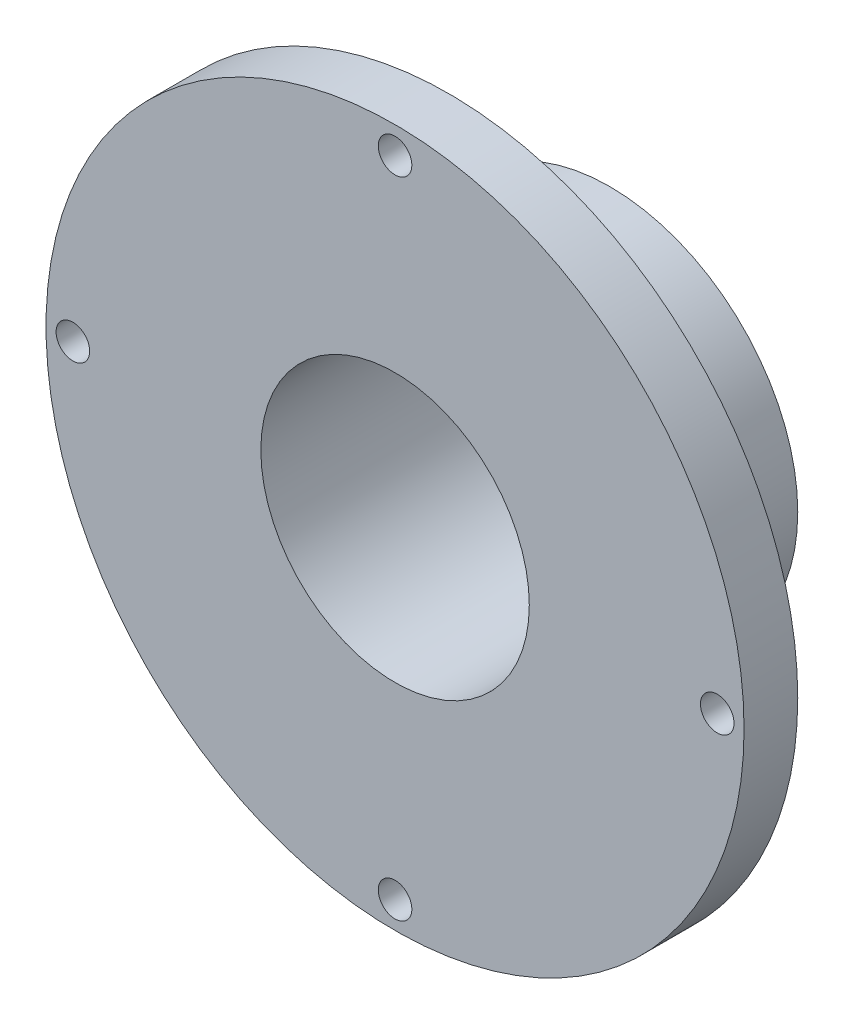
ISO-10303-21;
HEADER;
FILE_DESCRIPTION(('STEP AP214'),'2;1');
FILE_NAME('part.step','',(''),(''),'','','');
FILE_SCHEMA(('AUTOMOTIVE_DESIGN { 1 0 10303 214 1 1 1 1 }'));
ENDSEC;
DATA;
#1=APPLICATION_CONTEXT('core data for automotive mechanical design processes');
#2=APPLICATION_PROTOCOL_DEFINITION('international standard','automotive_design',2000,#1);
#3=PRODUCT_CONTEXT('',#1,'mechanical');
#4=PRODUCT('Part','Part','',(#3));
#5=PRODUCT_RELATED_PRODUCT_CATEGORY('part','',(#4));
#6=PRODUCT_DEFINITION_FORMATION('','',#4);
#7=PRODUCT_DEFINITION_CONTEXT('part definition',#1,'design');
#8=PRODUCT_DEFINITION('design','',#6,#7);
#9=PRODUCT_DEFINITION_SHAPE('','',#8);
#10=(LENGTH_UNIT() NAMED_UNIT(*) SI_UNIT(.MILLI.,.METRE.));
#11=(NAMED_UNIT(*) PLANE_ANGLE_UNIT() SI_UNIT($,.RADIAN.));
#12=(NAMED_UNIT(*) SI_UNIT($,.STERADIAN.) SOLID_ANGLE_UNIT());
#13=UNCERTAINTY_MEASURE_WITH_UNIT(LENGTH_MEASURE(1.E-05),#10,'distance_accuracy_value','');
#14=(GEOMETRIC_REPRESENTATION_CONTEXT(3) GLOBAL_UNCERTAINTY_ASSIGNED_CONTEXT((#13)) GLOBAL_UNIT_ASSIGNED_CONTEXT((#10,
#11,#12)) REPRESENTATION_CONTEXT('',''));
#15=CARTESIAN_POINT('',(0.,0.,0.));
#16=DIRECTION('',(0.,0.,1.));
#17=DIRECTION('',(1.,0.,0.));
#18=AXIS2_PLACEMENT_3D('',#15,#16,#17);
#19=CARTESIAN_POINT('',(0.,0.,25.4));
#20=DIRECTION('',(0.,0.,-1.));
#21=DIRECTION('',(-1.,0.,0.));
#22=AXIS2_PLACEMENT_3D('',#19,#20,#21);
#23=CYLINDRICAL_SURFACE('',#22,41.275);
#24=CARTESIAN_POINT('',(0.,0.,19.05));
#25=DIRECTION('',(0.,0.,1.));
#26=DIRECTION('',(1.,0.,0.));
#27=AXIS2_PLACEMENT_3D('',#24,#25,#26);
#28=CIRCLE('',#27,41.275);
#29=CARTESIAN_POINT('',(41.275,0.,19.05));
#30=VERTEX_POINT('',#29);
#31=EDGE_CURVE('E45',#30,#30,#28,.T.);
#32=ORIENTED_EDGE('',*,*,#31,.T.);
#33=EDGE_LOOP('',(#32));
#34=FACE_BOUND('',#33,.T.);
#35=CARTESIAN_POINT('',(0.,0.,25.4));
#36=DIRECTION('',(0.,0.,1.));
#37=DIRECTION('',(1.,0.,0.));
#38=AXIS2_PLACEMENT_3D('',#35,#36,#37);
#39=CIRCLE('',#38,41.275);
#40=CARTESIAN_POINT('',(41.275,0.,25.4));
#41=VERTEX_POINT('',#40);
#42=EDGE_CURVE('E12',#41,#41,#39,.T.);
#43=ORIENTED_EDGE('',*,*,#42,.F.);
#44=EDGE_LOOP('',(#43));
#45=FACE_BOUND('',#44,.T.);
#46=ADVANCED_FACE('F37',(#34,#45),#23,.T.);
#47=CARTESIAN_POINT('',(0.,0.,25.4));
#48=DIRECTION('',(0.,0.,1.));
#49=DIRECTION('',(1.,0.,0.));
#50=AXIS2_PLACEMENT_3D('',#47,#48,#49);
#51=PLANE('',#50);
#52=CARTESIAN_POINT('',(-38.1,0.,25.4));
#53=DIRECTION('',(0.,0.,1.));
#54=DIRECTION('',(1.,0.,0.));
#55=AXIS2_PLACEMENT_3D('',#52,#53,#54);
#56=CIRCLE('',#55,1.98437499999999);
#57=CARTESIAN_POINT('',(-36.115625,0.,25.4));
#58=VERTEX_POINT('',#57);
#59=EDGE_CURVE('E258',#58,#58,#56,.T.);
#60=ORIENTED_EDGE('',*,*,#59,.F.);
#61=EDGE_LOOP('',(#60));
#62=FACE_BOUND('',#61,.T.);
#63=CARTESIAN_POINT('',(0.,-38.1,25.4));
#64=DIRECTION('',(0.,0.,1.));
#65=DIRECTION('',(1.,0.,0.));
#66=AXIS2_PLACEMENT_3D('',#63,#64,#65);
#67=CIRCLE('',#66,1.98437499999999);
#68=CARTESIAN_POINT('',(1.98437499999999,-38.1,25.4));
#69=VERTEX_POINT('',#68);
#70=EDGE_CURVE('E101',#69,#69,#67,.T.);
#71=ORIENTED_EDGE('',*,*,#70,.F.);
#72=EDGE_LOOP('',(#71));
#73=FACE_BOUND('',#72,.T.);
#74=CARTESIAN_POINT('',(0.,38.1,25.4));
#75=DIRECTION('',(0.,0.,1.));
#76=DIRECTION('',(1.,0.,0.));
#77=AXIS2_PLACEMENT_3D('',#74,#75,#76);
#78=CIRCLE('',#77,1.98437499999999);
#79=CARTESIAN_POINT('',(1.98437499999999,38.1,25.4));
#80=VERTEX_POINT('',#79);
#81=EDGE_CURVE('E91',#80,#80,#78,.T.);
#82=ORIENTED_EDGE('',*,*,#81,.F.);
#83=EDGE_LOOP('',(#82));
#84=FACE_BOUND('',#83,.T.);
#85=CARTESIAN_POINT('',(38.1,0.,25.4));
#86=DIRECTION('',(0.,0.,1.));
#87=DIRECTION('',(1.,0.,0.));
#88=AXIS2_PLACEMENT_3D('',#85,#86,#87);
#89=CIRCLE('',#88,1.98437499999999);
#90=CARTESIAN_POINT('',(40.084375,0.,25.4));
#91=VERTEX_POINT('',#90);
#92=EDGE_CURVE('E90',#91,#91,#89,.T.);
#93=ORIENTED_EDGE('',*,*,#92,.F.);
#94=EDGE_LOOP('',(#93));
#95=FACE_BOUND('',#94,.T.);
#96=CARTESIAN_POINT('',(0.,0.,25.4));
#97=DIRECTION('',(0.,0.,-1.));
#98=DIRECTION('',(-1.,0.,0.));
#99=AXIS2_PLACEMENT_3D('',#96,#97,#98);
#100=CIRCLE('',#99,15.875);
#101=CARTESIAN_POINT('',(-15.875,0.,25.4));
#102=VERTEX_POINT('',#101);
#103=EDGE_CURVE('E76',#102,#102,#100,.T.);
#104=ORIENTED_EDGE('',*,*,#103,.T.);
#105=EDGE_LOOP('',(#104));
#106=FACE_BOUND('',#105,.T.);
#107=ORIENTED_EDGE('',*,*,#42,.T.);
#108=EDGE_LOOP('',(#107));
#109=FACE_BOUND('',#108,.T.);
#110=ADVANCED_FACE('F123',(#62,#73,#84,#95,#106,#109),#51,.T.);
#111=CARTESIAN_POINT('',(0.,0.,19.05));
#112=DIRECTION('',(0.,0.,1.));
#113=DIRECTION('',(1.,0.,0.));
#114=AXIS2_PLACEMENT_3D('',#111,#112,#113);
#115=PLANE('',#114);
#116=CARTESIAN_POINT('',(-38.1,0.,19.05));
#117=DIRECTION('',(0.,0.,1.));
#118=DIRECTION('',(1.,0.,0.));
#119=AXIS2_PLACEMENT_3D('',#116,#117,#118);
#120=CIRCLE('',#119,1.98437499999999);
#121=CARTESIAN_POINT('',(-36.115625,0.,19.05));
#122=VERTEX_POINT('',#121);
#123=EDGE_CURVE('E257',#122,#122,#120,.T.);
#124=ORIENTED_EDGE('',*,*,#123,.T.);
#125=EDGE_LOOP('',(#124));
#126=FACE_BOUND('',#125,.T.);
#127=CARTESIAN_POINT('',(0.,-38.1,19.05));
#128=DIRECTION('',(0.,0.,1.));
#129=DIRECTION('',(1.,0.,0.));
#130=AXIS2_PLACEMENT_3D('',#127,#128,#129);
#131=CIRCLE('',#130,1.98437499999999);
#132=CARTESIAN_POINT('',(1.98437499999999,-38.1,19.05));
#133=VERTEX_POINT('',#132);
#134=EDGE_CURVE('E40',#133,#133,#131,.T.);
#135=ORIENTED_EDGE('',*,*,#134,.T.);
#136=EDGE_LOOP('',(#135));
#137=FACE_BOUND('',#136,.T.);
#138=CARTESIAN_POINT('',(0.,38.1,19.05));
#139=DIRECTION('',(0.,0.,1.));
#140=DIRECTION('',(1.,0.,0.));
#141=AXIS2_PLACEMENT_3D('',#138,#139,#140);
#142=CIRCLE('',#141,1.98437499999999);
#143=CARTESIAN_POINT('',(1.98437499999999,38.1,19.05));
#144=VERTEX_POINT('',#143);
#145=EDGE_CURVE('E88',#144,#144,#142,.T.);
#146=ORIENTED_EDGE('',*,*,#145,.T.);
#147=EDGE_LOOP('',(#146));
#148=FACE_BOUND('',#147,.T.);
#149=CARTESIAN_POINT('',(38.1,0.,19.05));
#150=DIRECTION('',(0.,0.,1.));
#151=DIRECTION('',(1.,0.,0.));
#152=AXIS2_PLACEMENT_3D('',#149,#150,#151);
#153=CIRCLE('',#152,1.98437499999999);
#154=CARTESIAN_POINT('',(40.084375,0.,19.05));
#155=VERTEX_POINT('',#154);
#156=EDGE_CURVE('E69',#155,#155,#153,.T.);
#157=ORIENTED_EDGE('',*,*,#156,.T.);
#158=EDGE_LOOP('',(#157));
#159=FACE_BOUND('',#158,.T.);
#160=CARTESIAN_POINT('',(0.,0.,19.05));
#161=DIRECTION('',(0.,0.,1.));
#162=DIRECTION('',(1.,0.,0.));
#163=AXIS2_PLACEMENT_3D('',#160,#161,#162);
#164=CIRCLE('',#163,22.225);
#165=CARTESIAN_POINT('',(22.225,0.,19.05));
#166=VERTEX_POINT('',#165);
#167=EDGE_CURVE('E84',#166,#166,#164,.F.);
#168=ORIENTED_EDGE('',*,*,#167,.F.);
#169=EDGE_LOOP('',(#168));
#170=FACE_BOUND('',#169,.T.);
#171=ORIENTED_EDGE('',*,*,#31,.F.);
#172=EDGE_LOOP('',(#171));
#173=FACE_BOUND('',#172,.T.);
#174=ADVANCED_FACE('F107',(#126,#137,#148,#159,#170,#173),#115,.F.);
#175=CARTESIAN_POINT('',(0.,0.,156.010762869638));
#176=DIRECTION('',(0.,0.,-1.));
#177=DIRECTION('',(-1.,0.,0.));
#178=AXIS2_PLACEMENT_3D('',#175,#176,#177);
#179=CYLINDRICAL_SURFACE('',#178,22.225);
#180=CARTESIAN_POINT('',(0.,0.,0.));
#181=DIRECTION('',(0.,0.,-1.));
#182=DIRECTION('',(-1.,0.,0.));
#183=AXIS2_PLACEMENT_3D('',#180,#181,#182);
#184=CIRCLE('',#183,22.225);
#185=CARTESIAN_POINT('',(-22.225,0.,0.));
#186=VERTEX_POINT('',#185);
#187=EDGE_CURVE('E79',#186,#186,#184,.T.);
#188=ORIENTED_EDGE('',*,*,#187,.F.);
#189=EDGE_LOOP('',(#188));
#190=FACE_BOUND('',#189,.T.);
#191=ORIENTED_EDGE('',*,*,#167,.T.);
#192=EDGE_LOOP('',(#191));
#193=FACE_BOUND('',#192,.T.);
#194=ADVANCED_FACE('F136',(#190,#193),#179,.T.);
#195=CARTESIAN_POINT('',(0.,0.,0.));
#196=DIRECTION('',(0.,0.,1.));
#197=DIRECTION('',(1.,0.,0.));
#198=AXIS2_PLACEMENT_3D('',#195,#196,#197);
#199=PLANE('',#198);
#200=CARTESIAN_POINT('',(0.,18.415,0.));
#201=DIRECTION('',(0.,0.,-1.));
#202=DIRECTION('',(-1.,0.,0.));
#203=AXIS2_PLACEMENT_3D('',#200,#201,#202);
#204=CIRCLE('',#203,1.1303);
#205=CARTESIAN_POINT('',(-1.1303,18.415,0.));
#206=VERTEX_POINT('',#205);
#207=EDGE_CURVE('E63',#206,#206,#204,.T.);
#208=ORIENTED_EDGE('',*,*,#207,.F.);
#209=EDGE_LOOP('',(#208));
#210=FACE_BOUND('',#209,.T.);
#211=CARTESIAN_POINT('',(0.,-18.415,0.));
#212=DIRECTION('',(0.,0.,-1.));
#213=DIRECTION('',(-1.,0.,0.));
#214=AXIS2_PLACEMENT_3D('',#211,#212,#213);
#215=CIRCLE('',#214,1.1303);
#216=CARTESIAN_POINT('',(-1.1303,-18.415,0.));
#217=VERTEX_POINT('',#216);
#218=EDGE_CURVE('E62',#217,#217,#215,.T.);
#219=ORIENTED_EDGE('',*,*,#218,.F.);
#220=EDGE_LOOP('',(#219));
#221=FACE_BOUND('',#220,.T.);
#222=CARTESIAN_POINT('',(0.,0.,0.));
#223=DIRECTION('',(0.,0.,-1.));
#224=DIRECTION('',(-1.,0.,0.));
#225=AXIS2_PLACEMENT_3D('',#222,#223,#224);
#226=CIRCLE('',#225,15.875);
#227=CARTESIAN_POINT('',(-15.875,0.,0.));
#228=VERTEX_POINT('',#227);
#229=EDGE_CURVE('E75',#228,#228,#226,.T.);
#230=ORIENTED_EDGE('',*,*,#229,.F.);
#231=EDGE_LOOP('',(#230));
#232=FACE_BOUND('',#231,.T.);
#233=ORIENTED_EDGE('',*,*,#187,.T.);
#234=EDGE_LOOP('',(#233));
#235=FACE_BOUND('',#234,.T.);
#236=ADVANCED_FACE('F142',(#210,#221,#232,#235),#199,.F.);
#237=CARTESIAN_POINT('',(0.,0.,25.4));
#238=DIRECTION('',(0.,0.,-1.));
#239=DIRECTION('',(-1.,0.,0.));
#240=AXIS2_PLACEMENT_3D('',#237,#238,#239);
#241=CYLINDRICAL_SURFACE('',#240,15.875);
#242=ORIENTED_EDGE('',*,*,#103,.F.);
#243=EDGE_LOOP('',(#242));
#244=FACE_BOUND('',#243,.T.);
#245=ORIENTED_EDGE('',*,*,#229,.T.);
#246=EDGE_LOOP('',(#245));
#247=FACE_BOUND('',#246,.T.);
#248=ADVANCED_FACE('F149',(#244,#247),#241,.F.);
#249=CARTESIAN_POINT('',(0.,-18.415,7.5946));
#250=DIRECTION('',(0.,0.,-1.));
#251=DIRECTION('',(-1.,0.,0.));
#252=AXIS2_PLACEMENT_3D('',#249,#250,#251);
#253=CONICAL_SURFACE('',#252,1.1303,1.02974425867665);
#254=CARTESIAN_POINT('',(0.,-18.415,8.27375275768685));
#255=VERTEX_POINT('',#254);
#256=VERTEX_LOOP('',#255);
#257=FACE_BOUND('',#256,.T.);
#258=CARTESIAN_POINT('',(0.,-18.415,7.5946));
#259=DIRECTION('',(0.,0.,-1.));
#260=DIRECTION('',(-1.,0.,0.));
#261=AXIS2_PLACEMENT_3D('',#258,#259,#260);
#262=CIRCLE('',#261,1.1303);
#263=CARTESIAN_POINT('',(-1.1303,-18.415,7.5946));
#264=VERTEX_POINT('',#263);
#265=EDGE_CURVE('E66',#264,#264,#262,.T.);
#266=ORIENTED_EDGE('',*,*,#265,.T.);
#267=EDGE_LOOP('',(#266));
#268=FACE_BOUND('',#267,.T.);
#269=ADVANCED_FACE('F154',(#257,#268),#253,.F.);
#270=CARTESIAN_POINT('',(0.,-18.415,0.));
#271=DIRECTION('',(0.,0.,-1.));
#272=DIRECTION('',(-1.,0.,0.));
#273=AXIS2_PLACEMENT_3D('',#270,#271,#272);
#274=CYLINDRICAL_SURFACE('',#273,1.1303);
#275=ORIENTED_EDGE('',*,*,#265,.F.);
#276=EDGE_LOOP('',(#275));
#277=FACE_BOUND('',#276,.T.);
#278=ORIENTED_EDGE('',*,*,#218,.T.);
#279=EDGE_LOOP('',(#278));
#280=FACE_BOUND('',#279,.T.);
#281=ADVANCED_FACE('F56',(#277,#280),#274,.F.);
#282=CARTESIAN_POINT('',(0.,18.415,7.5946));
#283=DIRECTION('',(0.,0.,-1.));
#284=DIRECTION('',(-1.,0.,0.));
#285=AXIS2_PLACEMENT_3D('',#282,#283,#284);
#286=CONICAL_SURFACE('',#285,1.1303,1.02974425867665);
#287=CARTESIAN_POINT('',(0.,18.415,8.27375275768685));
#288=VERTEX_POINT('',#287);
#289=VERTEX_LOOP('',#288);
#290=FACE_BOUND('',#289,.T.);
#291=CARTESIAN_POINT('',(0.,18.415,7.5946));
#292=DIRECTION('',(0.,0.,-1.));
#293=DIRECTION('',(-1.,0.,0.));
#294=AXIS2_PLACEMENT_3D('',#291,#292,#293);
#295=CIRCLE('',#294,1.1303);
#296=CARTESIAN_POINT('',(-1.1303,18.415,7.5946));
#297=VERTEX_POINT('',#296);
#298=EDGE_CURVE('E60',#297,#297,#295,.T.);
#299=ORIENTED_EDGE('',*,*,#298,.T.);
#300=EDGE_LOOP('',(#299));
#301=FACE_BOUND('',#300,.T.);
#302=ADVANCED_FACE('F52',(#290,#301),#286,.F.);
#303=CARTESIAN_POINT('',(0.,18.415,0.));
#304=DIRECTION('',(0.,0.,-1.));
#305=DIRECTION('',(-1.,0.,0.));
#306=AXIS2_PLACEMENT_3D('',#303,#304,#305);
#307=CYLINDRICAL_SURFACE('',#306,1.1303);
#308=ORIENTED_EDGE('',*,*,#298,.F.);
#309=EDGE_LOOP('',(#308));
#310=FACE_BOUND('',#309,.T.);
#311=ORIENTED_EDGE('',*,*,#207,.T.);
#312=EDGE_LOOP('',(#311));
#313=FACE_BOUND('',#312,.T.);
#314=ADVANCED_FACE('F55',(#310,#313),#307,.F.);
#315=CARTESIAN_POINT('',(38.1,0.,25.4));
#316=DIRECTION('',(0.,0.,1.));
#317=DIRECTION('',(1.,0.,0.));
#318=AXIS2_PLACEMENT_3D('',#315,#316,#317);
#319=CYLINDRICAL_SURFACE('',#318,1.98437499999999);
#320=ORIENTED_EDGE('',*,*,#92,.T.);
#321=EDGE_LOOP('',(#320));
#322=FACE_BOUND('',#321,.T.);
#323=ORIENTED_EDGE('',*,*,#156,.F.);
#324=EDGE_LOOP('',(#323));
#325=FACE_BOUND('',#324,.T.);
#326=ADVANCED_FACE('F110',(#322,#325),#319,.F.);
#327=CARTESIAN_POINT('',(0.,38.1,25.4));
#328=DIRECTION('',(0.,0.,1.));
#329=DIRECTION('',(1.,0.,0.));
#330=AXIS2_PLACEMENT_3D('',#327,#328,#329);
#331=CYLINDRICAL_SURFACE('',#330,1.98437499999999);
#332=ORIENTED_EDGE('',*,*,#81,.T.);
#333=EDGE_LOOP('',(#332));
#334=FACE_BOUND('',#333,.T.);
#335=ORIENTED_EDGE('',*,*,#145,.F.);
#336=EDGE_LOOP('',(#335));
#337=FACE_BOUND('',#336,.T.);
#338=ADVANCED_FACE('F112',(#334,#337),#331,.F.);
#339=CARTESIAN_POINT('',(0.,-38.1,25.4));
#340=DIRECTION('',(0.,0.,1.));
#341=DIRECTION('',(1.,0.,0.));
#342=AXIS2_PLACEMENT_3D('',#339,#340,#341);
#343=CYLINDRICAL_SURFACE('',#342,1.98437499999999);
#344=ORIENTED_EDGE('',*,*,#70,.T.);
#345=EDGE_LOOP('',(#344));
#346=FACE_BOUND('',#345,.T.);
#347=ORIENTED_EDGE('',*,*,#134,.F.);
#348=EDGE_LOOP('',(#347));
#349=FACE_BOUND('',#348,.T.);
#350=ADVANCED_FACE('F119',(#346,#349),#343,.F.);
#351=CARTESIAN_POINT('',(-38.1,0.,25.4));
#352=DIRECTION('',(0.,0.,1.));
#353=DIRECTION('',(1.,0.,0.));
#354=AXIS2_PLACEMENT_3D('',#351,#352,#353);
#355=CYLINDRICAL_SURFACE('',#354,1.98437499999999);
#356=ORIENTED_EDGE('',*,*,#59,.T.);
#357=EDGE_LOOP('',(#356));
#358=FACE_BOUND('',#357,.T.);
#359=ORIENTED_EDGE('',*,*,#123,.F.);
#360=EDGE_LOOP('',(#359));
#361=FACE_BOUND('',#360,.T.);
#362=ADVANCED_FACE('F207',(#358,#361),#355,.F.);
#363=CLOSED_SHELL('',(#46,#110,#174,#194,#236,#248,#269,#281,#302,#314,#326,#338,#350,#362));
#364=MANIFOLD_SOLID_BREP('B2',#363);
#365=ADVANCED_BREP_SHAPE_REPRESENTATION('',(#18,#364),#14);
#366=SHAPE_DEFINITION_REPRESENTATION(#9,#365);
ENDSEC;
END-ISO-10303-21;
